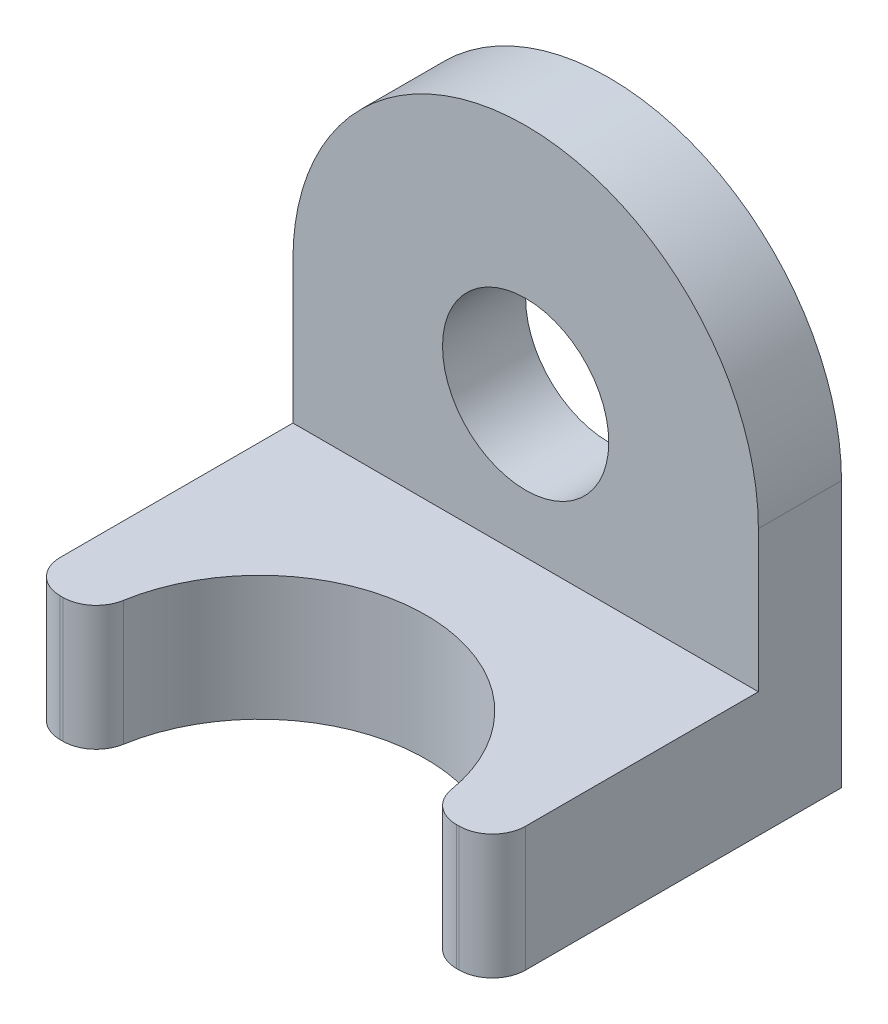
ISO-10303-21;
HEADER;
FILE_DESCRIPTION(('STEP AP214'),'2;1');
FILE_NAME('part.step','',(''),(''),'','','');
FILE_SCHEMA(('AUTOMOTIVE_DESIGN { 1 0 10303 214 1 1 1 1 }'));
ENDSEC;
DATA;
#1=APPLICATION_CONTEXT('core data for automotive mechanical design processes');
#2=APPLICATION_PROTOCOL_DEFINITION('international standard','automotive_design',2000,#1);
#3=PRODUCT_CONTEXT('',#1,'mechanical');
#4=PRODUCT('Part','Part','',(#3));
#5=PRODUCT_RELATED_PRODUCT_CATEGORY('part','',(#4));
#6=PRODUCT_DEFINITION_FORMATION('','',#4);
#7=PRODUCT_DEFINITION_CONTEXT('part definition',#1,'design');
#8=PRODUCT_DEFINITION('design','',#6,#7);
#9=PRODUCT_DEFINITION_SHAPE('','',#8);
#10=(LENGTH_UNIT() NAMED_UNIT(*) SI_UNIT(.MILLI.,.METRE.));
#11=(NAMED_UNIT(*) PLANE_ANGLE_UNIT() SI_UNIT($,.RADIAN.));
#12=(NAMED_UNIT(*) SI_UNIT($,.STERADIAN.) SOLID_ANGLE_UNIT());
#13=UNCERTAINTY_MEASURE_WITH_UNIT(LENGTH_MEASURE(1.E-05),#10,'distance_accuracy_value','');
#14=(GEOMETRIC_REPRESENTATION_CONTEXT(3) GLOBAL_UNCERTAINTY_ASSIGNED_CONTEXT((#13)) GLOBAL_UNIT_ASSIGNED_CONTEXT((#10,
#11,#12)) REPRESENTATION_CONTEXT('',''));
#15=CARTESIAN_POINT('',(0.,0.,0.));
#16=DIRECTION('',(0.,0.,1.));
#17=DIRECTION('',(1.,0.,0.));
#18=AXIS2_PLACEMENT_3D('',#15,#16,#17);
#19=CARTESIAN_POINT('',(0.,0.,13.335));
#20=DIRECTION('',(0.,0.,-1.));
#21=DIRECTION('',(-1.,0.,0.));
#22=AXIS2_PLACEMENT_3D('',#19,#20,#21);
#23=PLANE('',#22);
#24=DIRECTION('',(-1.,0.,0.));
#25=VECTOR('',#24,1.);
#26=CARTESIAN_POINT('',(-8.89,-5.3975,13.335));
#27=LINE('',#26,#25);
#28=CARTESIAN_POINT('',(7.61999999999999,-5.3975,13.335));
#29=VERTEX_POINT('',#28);
#30=CARTESIAN_POINT('',(7.51342132453651,-5.3975,13.335));
#31=VERTEX_POINT('',#30);
#32=EDGE_CURVE('E140',#29,#31,#27,.T.);
#33=ORIENTED_EDGE('',*,*,#32,.T.);
#34=DIRECTION('',(0.,-1.,0.));
#35=VECTOR('',#34,1.);
#36=CARTESIAN_POINT('',(7.51342132453651,0.,13.335));
#37=LINE('',#36,#35);
#38=CARTESIAN_POINT('',(7.51342132453651,-10.16,13.335));
#39=VERTEX_POINT('',#38);
#40=EDGE_CURVE('E211',#31,#39,#37,.T.);
#41=ORIENTED_EDGE('',*,*,#40,.T.);
#42=DIRECTION('',(1.,0.,0.));
#43=VECTOR('',#42,1.);
#44=CARTESIAN_POINT('',(-8.89,-10.16,13.335));
#45=LINE('',#44,#43);
#46=CARTESIAN_POINT('',(7.61999999999999,-10.16,13.335));
#47=VERTEX_POINT('',#46);
#48=EDGE_CURVE('E155',#39,#47,#45,.T.);
#49=ORIENTED_EDGE('',*,*,#48,.T.);
#50=DIRECTION('',(0.,1.,0.));
#51=VECTOR('',#50,1.);
#52=CARTESIAN_POINT('',(7.62,0.,13.335));
#53=LINE('',#52,#51);
#54=EDGE_CURVE('E206',#47,#29,#53,.T.);
#55=ORIENTED_EDGE('',*,*,#54,.T.);
#56=EDGE_LOOP('',(#33,#41,#49,#55));
#57=FACE_BOUND('',#56,.T.);
#58=ADVANCED_FACE('F36',(#57),#23,.F.);
#59=CARTESIAN_POINT('',(0.,0.,3.175));
#60=DIRECTION('',(0.,0.,1.));
#61=DIRECTION('',(1.,0.,0.));
#62=AXIS2_PLACEMENT_3D('',#59,#60,#61);
#63=PLANE('',#62);
#64=DIRECTION('',(-1.,0.,0.));
#65=VECTOR('',#64,1.);
#66=CARTESIAN_POINT('',(-8.89,-5.3975,3.175));
#67=LINE('',#66,#65);
#68=CARTESIAN_POINT('',(8.89,-5.3975,3.175));
#69=VERTEX_POINT('',#68);
#70=CARTESIAN_POINT('',(-8.89,-5.3975,3.175));
#71=VERTEX_POINT('',#70);
#72=EDGE_CURVE('E146',#69,#71,#67,.T.);
#73=ORIENTED_EDGE('',*,*,#72,.F.);
#74=DIRECTION('',(0.,1.,0.));
#75=VECTOR('',#74,1.);
#76=CARTESIAN_POINT('',(8.89,-10.16,3.175));
#77=LINE('',#76,#75);
#78=CARTESIAN_POINT('',(8.89,0.,3.175));
#79=VERTEX_POINT('',#78);
#80=EDGE_CURVE('E151',#69,#79,#77,.T.);
#81=ORIENTED_EDGE('',*,*,#80,.T.);
#82=CARTESIAN_POINT('',(0.,0.,3.175));
#83=DIRECTION('',(0.,0.,1.));
#84=DIRECTION('',(1.,0.,0.));
#85=AXIS2_PLACEMENT_3D('',#82,#83,#84);
#86=CIRCLE('',#85,8.89);
#87=CARTESIAN_POINT('',(-8.89,0.,3.175));
#88=VERTEX_POINT('',#87);
#89=EDGE_CURVE('E149',#79,#88,#86,.T.);
#90=ORIENTED_EDGE('',*,*,#89,.T.);
#91=DIRECTION('',(0.,-1.,0.));
#92=VECTOR('',#91,1.);
#93=CARTESIAN_POINT('',(-8.89,0.,3.175));
#94=LINE('',#93,#92);
#95=EDGE_CURVE('E131',#88,#71,#94,.T.);
#96=ORIENTED_EDGE('',*,*,#95,.T.);
#97=EDGE_LOOP('',(#73,#81,#90,#96));
#98=FACE_BOUND('',#97,.T.);
#99=CARTESIAN_POINT('',(0.,0.,3.175));
#100=DIRECTION('',(0.,0.,1.));
#101=DIRECTION('',(1.,0.,0.));
#102=AXIS2_PLACEMENT_3D('',#99,#100,#101);
#103=CIRCLE('',#102,3.175);
#104=CARTESIAN_POINT('',(3.175,0.,3.175));
#105=VERTEX_POINT('',#104);
#106=EDGE_CURVE('E166',#105,#105,#103,.T.);
#107=ORIENTED_EDGE('',*,*,#106,.F.);
#108=EDGE_LOOP('',(#107));
#109=FACE_BOUND('',#108,.T.);
#110=ADVANCED_FACE('F144',(#98,#109),#63,.T.);
#111=CARTESIAN_POINT('',(0.,0.,0.));
#112=DIRECTION('',(0.,0.,1.));
#113=DIRECTION('',(1.,0.,0.));
#114=AXIS2_PLACEMENT_3D('',#111,#112,#113);
#115=PLANE('',#114);
#116=CARTESIAN_POINT('',(0.,0.,0.));
#117=DIRECTION('',(0.,0.,1.));
#118=DIRECTION('',(1.,0.,0.));
#119=AXIS2_PLACEMENT_3D('',#116,#117,#118);
#120=CIRCLE('',#119,8.89);
#121=CARTESIAN_POINT('',(8.89,0.,0.));
#122=VERTEX_POINT('',#121);
#123=CARTESIAN_POINT('',(-8.89,0.,0.));
#124=VERTEX_POINT('',#123);
#125=EDGE_CURVE('E169',#122,#124,#120,.T.);
#126=ORIENTED_EDGE('',*,*,#125,.F.);
#127=DIRECTION('',(0.,1.,0.));
#128=VECTOR('',#127,1.);
#129=CARTESIAN_POINT('',(8.89,-10.16,0.));
#130=LINE('',#129,#128);
#131=CARTESIAN_POINT('',(8.89,-10.16,0.));
#132=VERTEX_POINT('',#131);
#133=EDGE_CURVE('E172',#132,#122,#130,.T.);
#134=ORIENTED_EDGE('',*,*,#133,.F.);
#135=DIRECTION('',(1.,0.,0.));
#136=VECTOR('',#135,1.);
#137=CARTESIAN_POINT('',(-8.89,-10.16,0.));
#138=LINE('',#137,#136);
#139=CARTESIAN_POINT('',(-8.89,-10.16,0.));
#140=VERTEX_POINT('',#139);
#141=EDGE_CURVE('E181',#140,#132,#138,.T.);
#142=ORIENTED_EDGE('',*,*,#141,.F.);
#143=DIRECTION('',(0.,-1.,0.));
#144=VECTOR('',#143,1.);
#145=CARTESIAN_POINT('',(-8.89,0.,0.));
#146=LINE('',#145,#144);
#147=EDGE_CURVE('E178',#124,#140,#146,.T.);
#148=ORIENTED_EDGE('',*,*,#147,.F.);
#149=EDGE_LOOP('',(#126,#134,#142,#148));
#150=FACE_BOUND('',#149,.T.);
#151=CARTESIAN_POINT('',(0.,0.,0.));
#152=DIRECTION('',(0.,0.,1.));
#153=DIRECTION('',(1.,0.,0.));
#154=AXIS2_PLACEMENT_3D('',#151,#152,#153);
#155=CIRCLE('',#154,3.175);
#156=CARTESIAN_POINT('',(3.175,0.,0.));
#157=VERTEX_POINT('',#156);
#158=EDGE_CURVE('E165',#157,#157,#155,.T.);
#159=ORIENTED_EDGE('',*,*,#158,.T.);
#160=EDGE_LOOP('',(#159));
#161=FACE_BOUND('',#160,.T.);
#162=ADVANCED_FACE('F249',(#150,#161),#115,.F.);
#163=CARTESIAN_POINT('',(0.,0.,3.175));
#164=DIRECTION('',(0.,0.,-1.));
#165=DIRECTION('',(-1.,0.,0.));
#166=AXIS2_PLACEMENT_3D('',#163,#164,#165);
#167=CYLINDRICAL_SURFACE('',#166,8.89);
#168=ORIENTED_EDGE('',*,*,#125,.T.);
#169=DIRECTION('',(0.,0.,-1.));
#170=VECTOR('',#169,1.);
#171=CARTESIAN_POINT('',(-8.89,0.,3.175));
#172=LINE('',#171,#170);
#173=EDGE_CURVE('E191',#88,#124,#172,.T.);
#174=ORIENTED_EDGE('',*,*,#173,.F.);
#175=ORIENTED_EDGE('',*,*,#89,.F.);
#176=DIRECTION('',(0.,0.,-1.));
#177=VECTOR('',#176,1.);
#178=CARTESIAN_POINT('',(8.89,0.,3.175));
#179=LINE('',#178,#177);
#180=EDGE_CURVE('E175',#79,#122,#179,.T.);
#181=ORIENTED_EDGE('',*,*,#180,.T.);
#182=EDGE_LOOP('',(#168,#174,#175,#181));
#183=FACE_BOUND('',#182,.T.);
#184=ADVANCED_FACE('F260',(#183),#167,.T.);
#185=CARTESIAN_POINT('',(-8.89,0.,3.175));
#186=DIRECTION('',(1.,0.,0.));
#187=DIRECTION('',(0.,1.,0.));
#188=AXIS2_PLACEMENT_3D('',#185,#186,#187);
#189=PLANE('',#188);
#190=DIRECTION('',(0.,0.,-1.));
#191=VECTOR('',#190,1.);
#192=CARTESIAN_POINT('',(-8.89,-10.16,3.175));
#193=LINE('',#192,#191);
#194=CARTESIAN_POINT('',(-8.89,-10.16,12.065));
#195=VERTEX_POINT('',#194);
#196=EDGE_CURVE('E189',#195,#140,#193,.T.);
#197=ORIENTED_EDGE('',*,*,#196,.F.);
#198=DIRECTION('',(0.,-1.,0.));
#199=VECTOR('',#198,1.);
#200=CARTESIAN_POINT('',(-8.89,0.,12.065));
#201=LINE('',#200,#199);
#202=CARTESIAN_POINT('',(-8.89,-5.3975,12.065));
#203=VERTEX_POINT('',#202);
#204=EDGE_CURVE('E134',#195,#203,#201,.F.);
#205=ORIENTED_EDGE('',*,*,#204,.T.);
#206=DIRECTION('',(0.,0.,-1.));
#207=VECTOR('',#206,1.);
#208=CARTESIAN_POINT('',(-8.89,-5.3975,13.335));
#209=LINE('',#208,#207);
#210=EDGE_CURVE('E126',#203,#71,#209,.T.);
#211=ORIENTED_EDGE('',*,*,#210,.T.);
#212=ORIENTED_EDGE('',*,*,#95,.F.);
#213=ORIENTED_EDGE('',*,*,#173,.T.);
#214=ORIENTED_EDGE('',*,*,#147,.T.);
#215=EDGE_LOOP('',(#197,#205,#211,#212,#213,#214));
#216=FACE_BOUND('',#215,.T.);
#217=ADVANCED_FACE('F129',(#216),#189,.F.);
#218=CARTESIAN_POINT('',(-8.89,-10.16,3.175));
#219=DIRECTION('',(0.,1.,0.));
#220=DIRECTION('',(0.,0.,1.));
#221=AXIS2_PLACEMENT_3D('',#218,#219,#220);
#222=PLANE('',#221);
#223=ORIENTED_EDGE('',*,*,#48,.F.);
#224=CARTESIAN_POINT('',(7.51342132453651,-10.16,12.065));
#225=DIRECTION('',(0.,1.,0.));
#226=DIRECTION('',(0.,0.,1.));
#227=AXIS2_PLACEMENT_3D('',#224,#225,#226);
#228=CIRCLE('',#227,1.27);
#229=CARTESIAN_POINT('',(6.26118443711376,-10.16,12.2766666666667));
#230=VERTEX_POINT('',#229);
#231=EDGE_CURVE('E216',#39,#230,#228,.F.);
#232=ORIENTED_EDGE('',*,*,#231,.T.);
#233=CARTESIAN_POINT('',(0.,-10.16,13.335));
#234=DIRECTION('',(0.,-1.,0.));
#235=DIRECTION('',(0.,0.,-1.));
#236=AXIS2_PLACEMENT_3D('',#233,#234,#235);
#237=CIRCLE('',#236,6.35);
#238=CARTESIAN_POINT('',(-6.26118443711376,-10.16,12.2766666666667));
#239=VERTEX_POINT('',#238);
#240=EDGE_CURVE('E160',#239,#230,#237,.T.);
#241=ORIENTED_EDGE('',*,*,#240,.F.);
#242=CARTESIAN_POINT('',(-7.51342132453651,-10.16,12.065));
#243=DIRECTION('',(0.,1.,0.));
#244=DIRECTION('',(0.,0.,1.));
#245=AXIS2_PLACEMENT_3D('',#242,#243,#244);
#246=CIRCLE('',#245,1.27);
#247=CARTESIAN_POINT('',(-7.51342132453651,-10.16,13.335));
#248=VERTEX_POINT('',#247);
#249=EDGE_CURVE('E214',#239,#248,#246,.F.);
#250=ORIENTED_EDGE('',*,*,#249,.T.);
#251=CARTESIAN_POINT('',(-7.61999999999999,-10.16,13.335));
#252=VERTEX_POINT('',#251);
#253=EDGE_CURVE('E158',#252,#248,#45,.T.);
#254=ORIENTED_EDGE('',*,*,#253,.F.);
#255=CARTESIAN_POINT('',(-7.61999999999999,-10.16,12.065));
#256=DIRECTION('',(0.,1.,0.));
#257=DIRECTION('',(0.,0.,1.));
#258=AXIS2_PLACEMENT_3D('',#255,#256,#257);
#259=CIRCLE('',#258,1.27);
#260=EDGE_CURVE('E199',#252,#195,#259,.F.);
#261=ORIENTED_EDGE('',*,*,#260,.T.);
#262=ORIENTED_EDGE('',*,*,#196,.T.);
#263=ORIENTED_EDGE('',*,*,#141,.T.);
#264=DIRECTION('',(0.,0.,-1.));
#265=VECTOR('',#264,1.);
#266=CARTESIAN_POINT('',(8.89,-10.16,3.175));
#267=LINE('',#266,#265);
#268=CARTESIAN_POINT('',(8.89,-10.16,12.065));
#269=VERTEX_POINT('',#268);
#270=EDGE_CURVE('E187',#269,#132,#267,.T.);
#271=ORIENTED_EDGE('',*,*,#270,.F.);
#272=CARTESIAN_POINT('',(7.61999999999999,-10.16,12.065));
#273=DIRECTION('',(0.,1.,0.));
#274=DIRECTION('',(0.,0.,1.));
#275=AXIS2_PLACEMENT_3D('',#272,#273,#274);
#276=CIRCLE('',#275,1.27);
#277=EDGE_CURVE('E196',#269,#47,#276,.F.);
#278=ORIENTED_EDGE('',*,*,#277,.T.);
#279=EDGE_LOOP('',(#223,#232,#241,#250,#254,#261,#262,#263,#271,#278));
#280=FACE_BOUND('',#279,.T.);
#281=ADVANCED_FACE('F233',(#280),#222,.F.);
#282=CARTESIAN_POINT('',(8.89,-10.16,3.175));
#283=DIRECTION('',(-1.,0.,0.));
#284=DIRECTION('',(0.,-1.,0.));
#285=AXIS2_PLACEMENT_3D('',#282,#283,#284);
#286=PLANE('',#285);
#287=DIRECTION('',(0.,0.,-1.));
#288=VECTOR('',#287,1.);
#289=CARTESIAN_POINT('',(8.89,-5.3975,13.335));
#290=LINE('',#289,#288);
#291=CARTESIAN_POINT('',(8.89,-5.3975,12.065));
#292=VERTEX_POINT('',#291);
#293=EDGE_CURVE('E139',#292,#69,#290,.T.);
#294=ORIENTED_EDGE('',*,*,#293,.F.);
#295=DIRECTION('',(0.,1.,0.));
#296=VECTOR('',#295,1.);
#297=CARTESIAN_POINT('',(8.89,-10.16,12.065));
#298=LINE('',#297,#296);
#299=EDGE_CURVE('E209',#292,#269,#298,.F.);
#300=ORIENTED_EDGE('',*,*,#299,.T.);
#301=ORIENTED_EDGE('',*,*,#270,.T.);
#302=ORIENTED_EDGE('',*,*,#133,.T.);
#303=ORIENTED_EDGE('',*,*,#180,.F.);
#304=ORIENTED_EDGE('',*,*,#80,.F.);
#305=EDGE_LOOP('',(#294,#300,#301,#302,#303,#304));
#306=FACE_BOUND('',#305,.T.);
#307=ADVANCED_FACE('F257',(#306),#286,.F.);
#308=CARTESIAN_POINT('',(0.,0.,3.175));
#309=DIRECTION('',(0.,0.,-1.));
#310=DIRECTION('',(-1.,0.,0.));
#311=AXIS2_PLACEMENT_3D('',#308,#309,#310);
#312=CYLINDRICAL_SURFACE('',#311,3.175);
#313=ORIENTED_EDGE('',*,*,#106,.T.);
#314=EDGE_LOOP('',(#313));
#315=FACE_BOUND('',#314,.T.);
#316=ORIENTED_EDGE('',*,*,#158,.F.);
#317=EDGE_LOOP('',(#316));
#318=FACE_BOUND('',#317,.T.);
#319=ADVANCED_FACE('F283',(#315,#318),#312,.F.);
#320=CARTESIAN_POINT('',(-8.89,-5.3975,13.335));
#321=DIRECTION('',(0.,-1.,0.));
#322=DIRECTION('',(0.,0.,-1.));
#323=AXIS2_PLACEMENT_3D('',#320,#321,#322);
#324=PLANE('',#323);
#325=CARTESIAN_POINT('',(0.,-5.3975,13.335));
#326=DIRECTION('',(0.,-1.,0.));
#327=DIRECTION('',(0.,0.,-1.));
#328=AXIS2_PLACEMENT_3D('',#325,#326,#327);
#329=CIRCLE('',#328,6.35);
#330=CARTESIAN_POINT('',(-6.26118443711376,-5.3975,12.2766666666667));
#331=VERTEX_POINT('',#330);
#332=CARTESIAN_POINT('',(6.26118443711376,-5.3975,12.2766666666667));
#333=VERTEX_POINT('',#332);
#334=EDGE_CURVE('E156',#331,#333,#329,.T.);
#335=ORIENTED_EDGE('',*,*,#334,.T.);
#336=CARTESIAN_POINT('',(7.51342132453651,-5.3975,12.065));
#337=DIRECTION('',(0.,-1.,0.));
#338=DIRECTION('',(0.,0.,-1.));
#339=AXIS2_PLACEMENT_3D('',#336,#337,#338);
#340=CIRCLE('',#339,1.27);
#341=EDGE_CURVE('E44',#333,#31,#340,.F.);
#342=ORIENTED_EDGE('',*,*,#341,.T.);
#343=ORIENTED_EDGE('',*,*,#32,.F.);
#344=CARTESIAN_POINT('',(7.62,-5.3975,12.065));
#345=DIRECTION('',(0.,-1.,0.));
#346=DIRECTION('',(0.,0.,-1.));
#347=AXIS2_PLACEMENT_3D('',#344,#345,#346);
#348=CIRCLE('',#347,1.27);
#349=EDGE_CURVE('E202',#29,#292,#348,.F.);
#350=ORIENTED_EDGE('',*,*,#349,.T.);
#351=ORIENTED_EDGE('',*,*,#293,.T.);
#352=ORIENTED_EDGE('',*,*,#72,.T.);
#353=ORIENTED_EDGE('',*,*,#210,.F.);
#354=CARTESIAN_POINT('',(-7.62,-5.3975,12.065));
#355=DIRECTION('',(0.,-1.,0.));
#356=DIRECTION('',(0.,0.,-1.));
#357=AXIS2_PLACEMENT_3D('',#354,#355,#356);
#358=CIRCLE('',#357,1.27);
#359=CARTESIAN_POINT('',(-7.62,-5.3975,13.335));
#360=VERTEX_POINT('',#359);
#361=EDGE_CURVE('E204',#203,#360,#358,.F.);
#362=ORIENTED_EDGE('',*,*,#361,.T.);
#363=CARTESIAN_POINT('',(-7.51342132453651,-5.3975,13.335));
#364=VERTEX_POINT('',#363);
#365=EDGE_CURVE('E229',#364,#360,#27,.T.);
#366=ORIENTED_EDGE('',*,*,#365,.F.);
#367=CARTESIAN_POINT('',(-7.51342132453651,-5.3975,12.065));
#368=DIRECTION('',(0.,-1.,0.));
#369=DIRECTION('',(0.,0.,-1.));
#370=AXIS2_PLACEMENT_3D('',#367,#368,#369);
#371=CIRCLE('',#370,1.27);
#372=EDGE_CURVE('E51',#364,#331,#371,.F.);
#373=ORIENTED_EDGE('',*,*,#372,.T.);
#374=EDGE_LOOP('',(#335,#342,#343,#350,#351,#352,#353,#362,#366,#373));
#375=FACE_BOUND('',#374,.T.);
#376=ADVANCED_FACE('F153',(#375),#324,.F.);
#377=ORIENTED_EDGE('',*,*,#253,.T.);
#378=DIRECTION('',(0.,-1.,0.));
#379=VECTOR('',#378,1.);
#380=CARTESIAN_POINT('',(-7.51342132453651,0.,13.335));
#381=LINE('',#380,#379);
#382=EDGE_CURVE('E11',#248,#364,#381,.F.);
#383=ORIENTED_EDGE('',*,*,#382,.T.);
#384=ORIENTED_EDGE('',*,*,#365,.T.);
#385=DIRECTION('',(0.,-1.,0.));
#386=VECTOR('',#385,1.);
#387=CARTESIAN_POINT('',(-7.62,0.,13.335));
#388=LINE('',#387,#386);
#389=EDGE_CURVE('E193',#360,#252,#388,.T.);
#390=ORIENTED_EDGE('',*,*,#389,.T.);
#391=EDGE_LOOP('',(#377,#383,#384,#390));
#392=FACE_BOUND('',#391,.T.);
#393=ADVANCED_FACE('F241',(#392),#23,.F.);
#394=CARTESIAN_POINT('',(0.,7.61999999999999,13.335));
#395=DIRECTION('',(0.,-1.,0.));
#396=DIRECTION('',(0.,0.,-1.));
#397=AXIS2_PLACEMENT_3D('',#394,#395,#396);
#398=CYLINDRICAL_SURFACE('',#397,6.35);
#399=ORIENTED_EDGE('',*,*,#240,.T.);
#400=DIRECTION('',(0.,-1.,0.));
#401=VECTOR('',#400,1.);
#402=CARTESIAN_POINT('',(6.26118443711376,7.61999999999999,12.2766666666667));
#403=LINE('',#402,#401);
#404=EDGE_CURVE('E58',#230,#333,#403,.F.);
#405=ORIENTED_EDGE('',*,*,#404,.T.);
#406=ORIENTED_EDGE('',*,*,#334,.F.);
#407=DIRECTION('',(0.,-1.,0.));
#408=VECTOR('',#407,1.);
#409=CARTESIAN_POINT('',(-6.26118443711376,7.61999999999999,12.2766666666667));
#410=LINE('',#409,#408);
#411=EDGE_CURVE('E218',#331,#239,#410,.T.);
#412=ORIENTED_EDGE('',*,*,#411,.T.);
#413=EDGE_LOOP('',(#399,#405,#406,#412));
#414=FACE_BOUND('',#413,.T.);
#415=ADVANCED_FACE('F235',(#414),#398,.F.);
#416=CARTESIAN_POINT('',(-7.62,0.,12.065));
#417=DIRECTION('',(0.,-1.,0.));
#418=DIRECTION('',(1.,0.,0.));
#419=AXIS2_PLACEMENT_3D('',#416,#417,#418);
#420=CYLINDRICAL_SURFACE('',#419,1.27);
#421=ORIENTED_EDGE('',*,*,#361,.F.);
#422=ORIENTED_EDGE('',*,*,#204,.F.);
#423=ORIENTED_EDGE('',*,*,#260,.F.);
#424=ORIENTED_EDGE('',*,*,#389,.F.);
#425=EDGE_LOOP('',(#421,#422,#423,#424));
#426=FACE_BOUND('',#425,.T.);
#427=ADVANCED_FACE('F244',(#426),#420,.T.);
#428=CARTESIAN_POINT('',(7.62,0.,12.065));
#429=DIRECTION('',(0.,1.,0.));
#430=DIRECTION('',(-1.,0.,0.));
#431=AXIS2_PLACEMENT_3D('',#428,#429,#430);
#432=CYLINDRICAL_SURFACE('',#431,1.27);
#433=ORIENTED_EDGE('',*,*,#277,.F.);
#434=ORIENTED_EDGE('',*,*,#299,.F.);
#435=ORIENTED_EDGE('',*,*,#349,.F.);
#436=ORIENTED_EDGE('',*,*,#54,.F.);
#437=EDGE_LOOP('',(#433,#434,#435,#436));
#438=FACE_BOUND('',#437,.T.);
#439=ADVANCED_FACE('F256',(#438),#432,.T.);
#440=CARTESIAN_POINT('',(7.51342132453651,7.61999999999999,12.065));
#441=DIRECTION('',(0.,-1.,0.));
#442=DIRECTION('',(0.,0.,-1.));
#443=AXIS2_PLACEMENT_3D('',#440,#441,#442);
#444=CYLINDRICAL_SURFACE('',#443,1.27);
#445=ORIENTED_EDGE('',*,*,#341,.F.);
#446=ORIENTED_EDGE('',*,*,#404,.F.);
#447=ORIENTED_EDGE('',*,*,#231,.F.);
#448=ORIENTED_EDGE('',*,*,#40,.F.);
#449=EDGE_LOOP('',(#445,#446,#447,#448));
#450=FACE_BOUND('',#449,.T.);
#451=ADVANCED_FACE('F230',(#450),#444,.T.);
#452=CARTESIAN_POINT('',(-7.51342132453651,7.61999999999999,12.065));
#453=DIRECTION('',(0.,-1.,0.));
#454=DIRECTION('',(0.,0.,-1.));
#455=AXIS2_PLACEMENT_3D('',#452,#453,#454);
#456=CYLINDRICAL_SURFACE('',#455,1.27);
#457=ORIENTED_EDGE('',*,*,#249,.F.);
#458=ORIENTED_EDGE('',*,*,#411,.F.);
#459=ORIENTED_EDGE('',*,*,#372,.F.);
#460=ORIENTED_EDGE('',*,*,#382,.F.);
#461=EDGE_LOOP('',(#457,#458,#459,#460));
#462=FACE_BOUND('',#461,.T.);
#463=ADVANCED_FACE('F38',(#462),#456,.T.);
#464=CLOSED_SHELL('',(#58,#110,#162,#184,#217,#281,#307,#319,#376,#393,#415,#427,#439,#451,#463));
#465=MANIFOLD_SOLID_BREP('B2',#464);
#466=ADVANCED_BREP_SHAPE_REPRESENTATION('',(#18,#465),#14);
#467=SHAPE_DEFINITION_REPRESENTATION(#9,#466);
ENDSEC;
END-ISO-10303-21;
